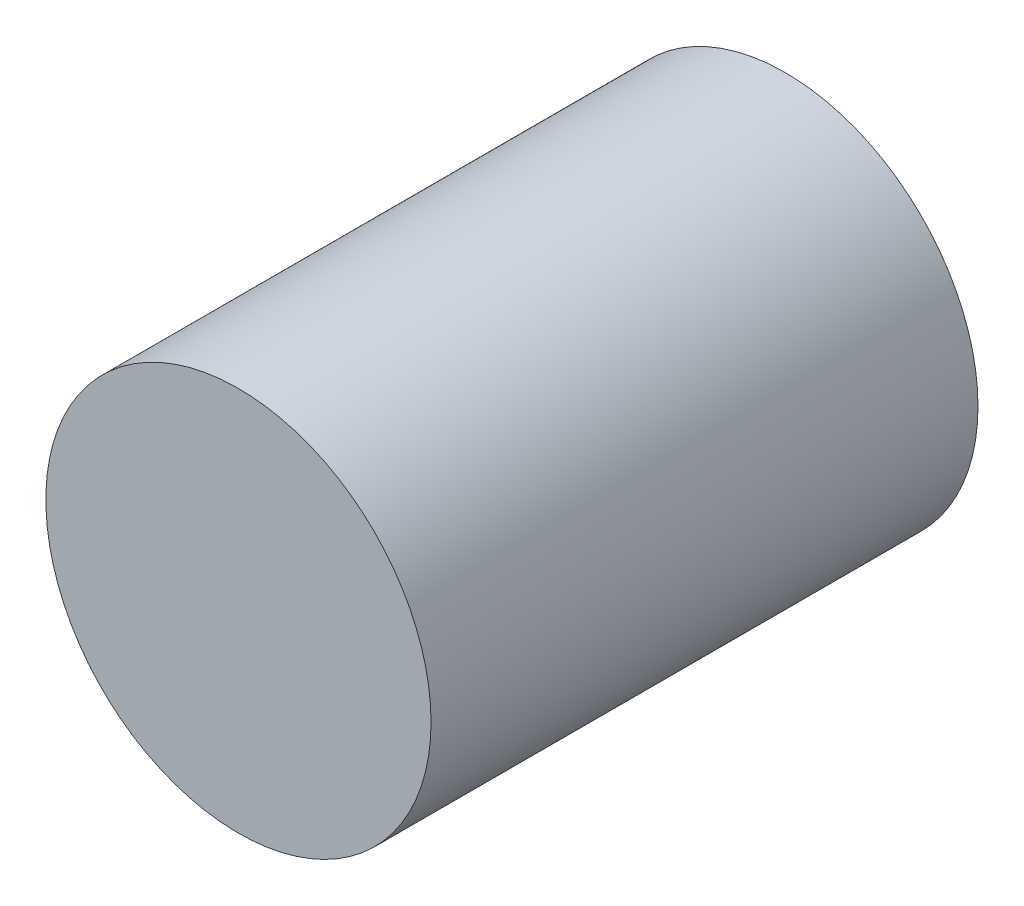
ISO-10303-21;
HEADER;
FILE_DESCRIPTION(('STEP AP214'),'2;1');
FILE_NAME('part.step','',(''),(''),'','','');
FILE_SCHEMA(('AUTOMOTIVE_DESIGN { 1 0 10303 214 1 1 1 1 }'));
ENDSEC;
DATA;
#1=APPLICATION_CONTEXT('core data for automotive mechanical design processes');
#2=APPLICATION_PROTOCOL_DEFINITION('international standard','automotive_design',2000,#1);
#3=PRODUCT_CONTEXT('',#1,'mechanical');
#4=PRODUCT('Part','Part','',(#3));
#5=PRODUCT_RELATED_PRODUCT_CATEGORY('part','',(#4));
#6=PRODUCT_DEFINITION_FORMATION('','',#4);
#7=PRODUCT_DEFINITION_CONTEXT('part definition',#1,'design');
#8=PRODUCT_DEFINITION('design','',#6,#7);
#9=PRODUCT_DEFINITION_SHAPE('','',#8);
#10=(LENGTH_UNIT() NAMED_UNIT(*) SI_UNIT(.MILLI.,.METRE.));
#11=(NAMED_UNIT(*) PLANE_ANGLE_UNIT() SI_UNIT($,.RADIAN.));
#12=(NAMED_UNIT(*) SI_UNIT($,.STERADIAN.) SOLID_ANGLE_UNIT());
#13=UNCERTAINTY_MEASURE_WITH_UNIT(LENGTH_MEASURE(1.E-05),#10,'distance_accuracy_value','');
#14=(GEOMETRIC_REPRESENTATION_CONTEXT(3) GLOBAL_UNCERTAINTY_ASSIGNED_CONTEXT((#13)) GLOBAL_UNIT_ASSIGNED_CONTEXT((#10,
#11,#12)) REPRESENTATION_CONTEXT('',''));
#15=CARTESIAN_POINT('',(0.,0.,0.));
#16=DIRECTION('',(0.,0.,1.));
#17=DIRECTION('',(1.,0.,0.));
#18=AXIS2_PLACEMENT_3D('',#15,#16,#17);
#19=CARTESIAN_POINT('',(0.,0.,14.2));
#20=DIRECTION('',(0.,0.,-1.));
#21=DIRECTION('',(-1.,0.,0.));
#22=AXIS2_PLACEMENT_3D('',#19,#20,#21);
#23=CYLINDRICAL_SURFACE('',#22,5.);
#24=CARTESIAN_POINT('',(0.,0.,14.2));
#25=DIRECTION('',(0.,0.,1.));
#26=DIRECTION('',(1.,0.,0.));
#27=AXIS2_PLACEMENT_3D('',#24,#25,#26);
#28=CIRCLE('',#27,5.);
#29=CARTESIAN_POINT('',(5.,0.,14.2));
#30=VERTEX_POINT('',#29);
#31=EDGE_CURVE('E10',#30,#30,#28,.T.);
#32=ORIENTED_EDGE('',*,*,#31,.F.);
#33=EDGE_LOOP('',(#32));
#34=FACE_BOUND('',#33,.T.);
#35=CARTESIAN_POINT('',(0.,0.,0.));
#36=DIRECTION('',(0.,0.,1.));
#37=DIRECTION('',(1.,0.,0.));
#38=AXIS2_PLACEMENT_3D('',#35,#36,#37);
#39=CIRCLE('',#38,5.);
#40=CARTESIAN_POINT('',(5.,0.,0.));
#41=VERTEX_POINT('',#40);
#42=EDGE_CURVE('E33',#41,#41,#39,.T.);
#43=ORIENTED_EDGE('',*,*,#42,.T.);
#44=EDGE_LOOP('',(#43));
#45=FACE_BOUND('',#44,.T.);
#46=ADVANCED_FACE('F30',(#34,#45),#23,.T.);
#47=CARTESIAN_POINT('',(0.,0.,14.2));
#48=DIRECTION('',(0.,0.,1.));
#49=DIRECTION('',(1.,0.,0.));
#50=AXIS2_PLACEMENT_3D('',#47,#48,#49);
#51=PLANE('',#50);
#52=ORIENTED_EDGE('',*,*,#31,.T.);
#53=EDGE_LOOP('',(#52));
#54=FACE_BOUND('',#53,.T.);
#55=ADVANCED_FACE('F45',(#54),#51,.T.);
#56=CARTESIAN_POINT('',(0.,0.,0.));
#57=DIRECTION('',(0.,0.,1.));
#58=DIRECTION('',(1.,0.,0.));
#59=AXIS2_PLACEMENT_3D('',#56,#57,#58);
#60=PLANE('',#59);
#61=ORIENTED_EDGE('',*,*,#42,.F.);
#62=EDGE_LOOP('',(#61));
#63=FACE_BOUND('',#62,.T.);
#64=ADVANCED_FACE('F43',(#63),#60,.F.);
#65=CLOSED_SHELL('',(#46,#55,#64));
#66=MANIFOLD_SOLID_BREP('B2',#65);
#67=ADVANCED_BREP_SHAPE_REPRESENTATION('',(#18,#66),#14);
#68=SHAPE_DEFINITION_REPRESENTATION(#9,#67);
ENDSEC;
END-ISO-10303-21;
